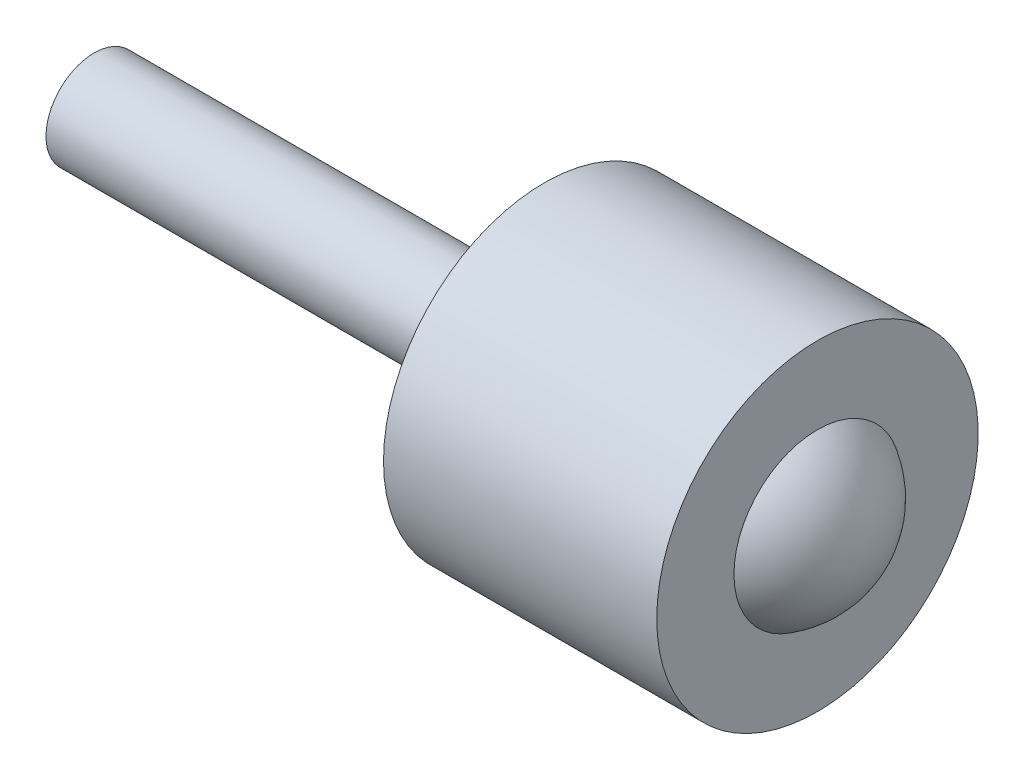
ISO-10303-21;
HEADER;
FILE_DESCRIPTION(('STEP AP214'),'2;1');
FILE_NAME('part.step','',(''),(''),'','','');
FILE_SCHEMA(('AUTOMOTIVE_DESIGN { 1 0 10303 214 1 1 1 1 }'));
ENDSEC;
DATA;
#1=APPLICATION_CONTEXT('core data for automotive mechanical design processes');
#2=APPLICATION_PROTOCOL_DEFINITION('international standard','automotive_design',2000,#1);
#3=PRODUCT_CONTEXT('',#1,'mechanical');
#4=PRODUCT('Part','Part','',(#3));
#5=PRODUCT_RELATED_PRODUCT_CATEGORY('part','',(#4));
#6=PRODUCT_DEFINITION_FORMATION('','',#4);
#7=PRODUCT_DEFINITION_CONTEXT('part definition',#1,'design');
#8=PRODUCT_DEFINITION('design','',#6,#7);
#9=PRODUCT_DEFINITION_SHAPE('','',#8);
#10=(LENGTH_UNIT() NAMED_UNIT(*) SI_UNIT(.MILLI.,.METRE.));
#11=(NAMED_UNIT(*) PLANE_ANGLE_UNIT() SI_UNIT($,.RADIAN.));
#12=(NAMED_UNIT(*) SI_UNIT($,.STERADIAN.) SOLID_ANGLE_UNIT());
#13=UNCERTAINTY_MEASURE_WITH_UNIT(LENGTH_MEASURE(1.E-05),#10,'distance_accuracy_value','');
#14=(GEOMETRIC_REPRESENTATION_CONTEXT(3) GLOBAL_UNCERTAINTY_ASSIGNED_CONTEXT((#13)) GLOBAL_UNIT_ASSIGNED_CONTEXT((#10,
#11,#12)) REPRESENTATION_CONTEXT('',''));
#15=CARTESIAN_POINT('',(0.,0.,0.));
#16=DIRECTION('',(0.,0.,1.));
#17=DIRECTION('',(1.,0.,0.));
#18=AXIS2_PLACEMENT_3D('',#15,#16,#17);
#19=CARTESIAN_POINT('',(0.,0.,0.));
#20=DIRECTION('',(1.,0.,0.));
#21=DIRECTION('',(0.,0.,-1.));
#22=AXIS2_PLACEMENT_3D('',#19,#20,#21);
#23=PLANE('',#22);
#24=CARTESIAN_POINT('',(0.,0.,0.));
#25=DIRECTION('',(-1.,0.,0.));
#26=DIRECTION('',(0.,0.,1.));
#27=AXIS2_PLACEMENT_3D('',#24,#25,#26);
#28=CIRCLE('',#27,3.);
#29=CARTESIAN_POINT('',(0.,0.,3.));
#30=VERTEX_POINT('',#29);
#31=EDGE_CURVE('E49',#30,#30,#28,.T.);
#32=ORIENTED_EDGE('',*,*,#31,.T.);
#33=EDGE_LOOP('',(#32));
#34=FACE_BOUND('',#33,.T.);
#35=ADVANCED_FACE('F30',(#34),#23,.F.);
#36=CARTESIAN_POINT('',(42.,0.,0.));
#37=DIRECTION('',(-1.,0.,0.));
#38=DIRECTION('',(0.,1.,0.));
#39=AXIS2_PLACEMENT_3D('',#36,#37,#38);
#40=SPHERICAL_SURFACE('',#39,6.);
#41=CARTESIAN_POINT('',(45.,0.,0.));
#42=DIRECTION('',(-1.,0.,0.));
#43=DIRECTION('',(0.,0.,1.));
#44=AXIS2_PLACEMENT_3D('',#41,#42,#43);
#45=CIRCLE('',#44,5.19615242270664);
#46=CARTESIAN_POINT('',(45.,0.,5.19615242270664));
#47=VERTEX_POINT('',#46);
#48=EDGE_CURVE('E10',#47,#47,#45,.T.);
#49=ORIENTED_EDGE('',*,*,#48,.F.);
#50=EDGE_LOOP('',(#49));
#51=FACE_BOUND('',#50,.T.);
#52=ADVANCED_FACE('F73',(#51),#40,.T.);
#53=CARTESIAN_POINT('',(45.,10.,0.));
#54=DIRECTION('',(-1.,0.,0.));
#55=DIRECTION('',(0.,0.,1.));
#56=AXIS2_PLACEMENT_3D('',#53,#54,#55);
#57=PLANE('',#56);
#58=CARTESIAN_POINT('',(45.,0.,0.));
#59=DIRECTION('',(-1.,0.,0.));
#60=DIRECTION('',(0.,0.,1.));
#61=AXIS2_PLACEMENT_3D('',#58,#59,#60);
#62=CIRCLE('',#61,10.);
#63=CARTESIAN_POINT('',(45.,0.,10.));
#64=VERTEX_POINT('',#63);
#65=EDGE_CURVE('E36',#64,#64,#62,.T.);
#66=ORIENTED_EDGE('',*,*,#65,.F.);
#67=EDGE_LOOP('',(#66));
#68=FACE_BOUND('',#67,.T.);
#69=ORIENTED_EDGE('',*,*,#48,.T.);
#70=EDGE_LOOP('',(#69));
#71=FACE_BOUND('',#70,.T.);
#72=ADVANCED_FACE('F68',(#68,#71),#57,.F.);
#73=CARTESIAN_POINT('',(-2.4,0.,0.));
#74=DIRECTION('',(-1.,0.,0.));
#75=DIRECTION('',(0.,0.,1.));
#76=AXIS2_PLACEMENT_3D('',#73,#74,#75);
#77=CYLINDRICAL_SURFACE('',#76,10.);
#78=CARTESIAN_POINT('',(28.,0.,0.));
#79=DIRECTION('',(-1.,0.,0.));
#80=DIRECTION('',(0.,0.,1.));
#81=AXIS2_PLACEMENT_3D('',#78,#79,#80);
#82=CIRCLE('',#81,10.);
#83=CARTESIAN_POINT('',(28.,0.,10.));
#84=VERTEX_POINT('',#83);
#85=EDGE_CURVE('E40',#84,#84,#82,.T.);
#86=ORIENTED_EDGE('',*,*,#85,.F.);
#87=EDGE_LOOP('',(#86));
#88=FACE_BOUND('',#87,.T.);
#89=ORIENTED_EDGE('',*,*,#65,.T.);
#90=EDGE_LOOP('',(#89));
#91=FACE_BOUND('',#90,.T.);
#92=ADVANCED_FACE('F63',(#88,#91),#77,.T.);
#93=CARTESIAN_POINT('',(28.,3.,0.));
#94=DIRECTION('',(1.,0.,0.));
#95=DIRECTION('',(0.,0.,-1.));
#96=AXIS2_PLACEMENT_3D('',#93,#94,#95);
#97=PLANE('',#96);
#98=CARTESIAN_POINT('',(28.,0.,0.));
#99=DIRECTION('',(-1.,0.,0.));
#100=DIRECTION('',(0.,0.,1.));
#101=AXIS2_PLACEMENT_3D('',#98,#99,#100);
#102=CIRCLE('',#101,3.);
#103=CARTESIAN_POINT('',(28.,0.,3.));
#104=VERTEX_POINT('',#103);
#105=EDGE_CURVE('E44',#104,#104,#102,.T.);
#106=ORIENTED_EDGE('',*,*,#105,.F.);
#107=EDGE_LOOP('',(#106));
#108=FACE_BOUND('',#107,.T.);
#109=ORIENTED_EDGE('',*,*,#85,.T.);
#110=EDGE_LOOP('',(#109));
#111=FACE_BOUND('',#110,.T.);
#112=ADVANCED_FACE('F57',(#108,#111),#97,.F.);
#113=CARTESIAN_POINT('',(-2.4,0.,0.));
#114=DIRECTION('',(-1.,0.,0.));
#115=DIRECTION('',(0.,0.,1.));
#116=AXIS2_PLACEMENT_3D('',#113,#114,#115);
#117=CYLINDRICAL_SURFACE('',#116,3.);
#118=ORIENTED_EDGE('',*,*,#31,.F.);
#119=EDGE_LOOP('',(#118));
#120=FACE_BOUND('',#119,.T.);
#121=ORIENTED_EDGE('',*,*,#105,.T.);
#122=EDGE_LOOP('',(#121));
#123=FACE_BOUND('',#122,.T.);
#124=ADVANCED_FACE('F54',(#120,#123),#117,.T.);
#125=CLOSED_SHELL('',(#35,#52,#72,#92,#112,#124));
#126=MANIFOLD_SOLID_BREP('B2',#125);
#127=ADVANCED_BREP_SHAPE_REPRESENTATION('',(#18,#126),#14);
#128=SHAPE_DEFINITION_REPRESENTATION(#9,#127);
ENDSEC;
END-ISO-10303-21;
